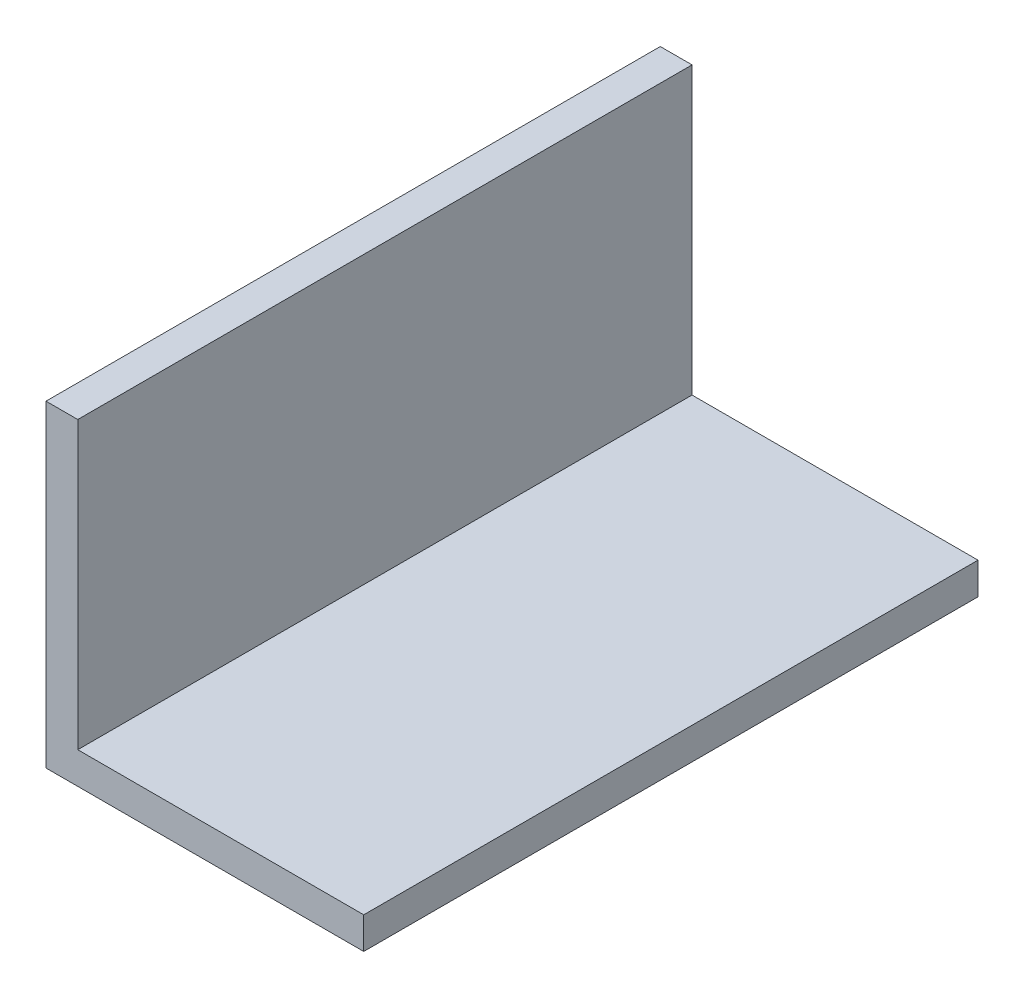
ISO-10303-21;
HEADER;
FILE_DESCRIPTION(('STEP AP214'),'2;1');
FILE_NAME('part.step','',(''),(''),'','','');
FILE_SCHEMA(('AUTOMOTIVE_DESIGN { 1 0 10303 214 1 1 1 1 }'));
ENDSEC;
DATA;
#1=APPLICATION_CONTEXT('core data for automotive mechanical design processes');
#2=APPLICATION_PROTOCOL_DEFINITION('international standard','automotive_design',2000,#1);
#3=PRODUCT_CONTEXT('',#1,'mechanical');
#4=PRODUCT('Part','Part','',(#3));
#5=PRODUCT_RELATED_PRODUCT_CATEGORY('part','',(#4));
#6=PRODUCT_DEFINITION_FORMATION('','',#4);
#7=PRODUCT_DEFINITION_CONTEXT('part definition',#1,'design');
#8=PRODUCT_DEFINITION('design','',#6,#7);
#9=PRODUCT_DEFINITION_SHAPE('','',#8);
#10=(LENGTH_UNIT() NAMED_UNIT(*) SI_UNIT(.MILLI.,.METRE.));
#11=(NAMED_UNIT(*) PLANE_ANGLE_UNIT() SI_UNIT($,.RADIAN.));
#12=(NAMED_UNIT(*) SI_UNIT($,.STERADIAN.) SOLID_ANGLE_UNIT());
#13=UNCERTAINTY_MEASURE_WITH_UNIT(LENGTH_MEASURE(1.E-05),#10,'distance_accuracy_value','');
#14=(GEOMETRIC_REPRESENTATION_CONTEXT(3) GLOBAL_UNCERTAINTY_ASSIGNED_CONTEXT((#13)) GLOBAL_UNIT_ASSIGNED_CONTEXT((#10,
#11,#12)) REPRESENTATION_CONTEXT('',''));
#15=CARTESIAN_POINT('',(0.,0.,0.));
#16=DIRECTION('',(0.,0.,1.));
#17=DIRECTION('',(1.,0.,0.));
#18=AXIS2_PLACEMENT_3D('',#15,#16,#17);
#19=CARTESIAN_POINT('',(0.,30.,58.));
#20=DIRECTION('',(0.,-1.,0.));
#21=DIRECTION('',(0.,0.,-1.));
#22=AXIS2_PLACEMENT_3D('',#19,#20,#21);
#23=PLANE('',#22);
#24=DIRECTION('',(-1.,0.,0.));
#25=VECTOR('',#24,1.);
#26=CARTESIAN_POINT('',(0.,30.,0.));
#27=LINE('',#26,#25);
#28=CARTESIAN_POINT('',(3.,30.,0.));
#29=VERTEX_POINT('',#28);
#30=CARTESIAN_POINT('',(0.,30.,0.));
#31=VERTEX_POINT('',#30);
#32=EDGE_CURVE('E119',#29,#31,#27,.T.);
#33=ORIENTED_EDGE('',*,*,#32,.T.);
#34=DIRECTION('',(0.,0.,-1.));
#35=VECTOR('',#34,1.);
#36=CARTESIAN_POINT('',(0.,30.,58.));
#37=LINE('',#36,#35);
#38=CARTESIAN_POINT('',(0.,30.,58.));
#39=VERTEX_POINT('',#38);
#40=EDGE_CURVE('E11',#39,#31,#37,.T.);
#41=ORIENTED_EDGE('',*,*,#40,.F.);
#42=DIRECTION('',(-1.,0.,0.));
#43=VECTOR('',#42,1.);
#44=CARTESIAN_POINT('',(0.,30.,58.));
#45=LINE('',#44,#43);
#46=CARTESIAN_POINT('',(3.,30.,58.));
#47=VERTEX_POINT('',#46);
#48=EDGE_CURVE('E129',#47,#39,#45,.T.);
#49=ORIENTED_EDGE('',*,*,#48,.F.);
#50=DIRECTION('',(0.,0.,-1.));
#51=VECTOR('',#50,1.);
#52=CARTESIAN_POINT('',(3.,30.,58.));
#53=LINE('',#52,#51);
#54=EDGE_CURVE('E115',#47,#29,#53,.T.);
#55=ORIENTED_EDGE('',*,*,#54,.T.);
#56=EDGE_LOOP('',(#33,#41,#49,#55));
#57=FACE_BOUND('',#56,.T.);
#58=ADVANCED_FACE('F35',(#57),#23,.F.);
#59=CARTESIAN_POINT('',(0.,30.,58.));
#60=DIRECTION('',(1.,0.,0.));
#61=DIRECTION('',(0.,1.,0.));
#62=AXIS2_PLACEMENT_3D('',#59,#60,#61);
#63=PLANE('',#62);
#64=DIRECTION('',(0.,-1.,0.));
#65=VECTOR('',#64,1.);
#66=CARTESIAN_POINT('',(0.,30.,0.));
#67=LINE('',#66,#65);
#68=CARTESIAN_POINT('',(0.,0.,0.));
#69=VERTEX_POINT('',#68);
#70=EDGE_CURVE('E122',#31,#69,#67,.T.);
#71=ORIENTED_EDGE('',*,*,#70,.T.);
#72=DIRECTION('',(0.,0.,-1.));
#73=VECTOR('',#72,1.);
#74=CARTESIAN_POINT('',(0.,0.,58.));
#75=LINE('',#74,#73);
#76=CARTESIAN_POINT('',(0.,0.,58.));
#77=VERTEX_POINT('',#76);
#78=EDGE_CURVE('E43',#77,#69,#75,.T.);
#79=ORIENTED_EDGE('',*,*,#78,.F.);
#80=DIRECTION('',(0.,-1.,0.));
#81=VECTOR('',#80,1.);
#82=CARTESIAN_POINT('',(0.,30.,58.));
#83=LINE('',#82,#81);
#84=EDGE_CURVE('E88',#39,#77,#83,.T.);
#85=ORIENTED_EDGE('',*,*,#84,.F.);
#86=ORIENTED_EDGE('',*,*,#40,.T.);
#87=EDGE_LOOP('',(#71,#79,#85,#86));
#88=FACE_BOUND('',#87,.T.);
#89=ADVANCED_FACE('F153',(#88),#63,.F.);
#90=CARTESIAN_POINT('',(0.,0.,58.));
#91=DIRECTION('',(0.,1.,0.));
#92=DIRECTION('',(0.,0.,1.));
#93=AXIS2_PLACEMENT_3D('',#90,#91,#92);
#94=PLANE('',#93);
#95=DIRECTION('',(1.,0.,0.));
#96=VECTOR('',#95,1.);
#97=CARTESIAN_POINT('',(0.,0.,0.));
#98=LINE('',#97,#96);
#99=CARTESIAN_POINT('',(30.,0.,0.));
#100=VERTEX_POINT('',#99);
#101=EDGE_CURVE('E124',#69,#100,#98,.T.);
#102=ORIENTED_EDGE('',*,*,#101,.T.);
#103=DIRECTION('',(0.,0.,-1.));
#104=VECTOR('',#103,1.);
#105=CARTESIAN_POINT('',(30.,0.,58.));
#106=LINE('',#105,#104);
#107=CARTESIAN_POINT('',(30.,0.,58.));
#108=VERTEX_POINT('',#107);
#109=EDGE_CURVE('E110',#108,#100,#106,.T.);
#110=ORIENTED_EDGE('',*,*,#109,.F.);
#111=DIRECTION('',(1.,0.,0.));
#112=VECTOR('',#111,1.);
#113=CARTESIAN_POINT('',(0.,0.,58.));
#114=LINE('',#113,#112);
#115=EDGE_CURVE('E101',#77,#108,#114,.T.);
#116=ORIENTED_EDGE('',*,*,#115,.F.);
#117=ORIENTED_EDGE('',*,*,#78,.T.);
#118=EDGE_LOOP('',(#102,#110,#116,#117));
#119=FACE_BOUND('',#118,.T.);
#120=ADVANCED_FACE('F135',(#119),#94,.F.);
#121=CARTESIAN_POINT('',(30.,3.,58.));
#122=DIRECTION('',(-1.,0.,0.));
#123=DIRECTION('',(0.,0.,1.));
#124=AXIS2_PLACEMENT_3D('',#121,#122,#123);
#125=PLANE('',#124);
#126=DIRECTION('',(0.,1.,0.));
#127=VECTOR('',#126,1.);
#128=CARTESIAN_POINT('',(30.,3.,0.));
#129=LINE('',#128,#127);
#130=CARTESIAN_POINT('',(30.,3.,0.));
#131=VERTEX_POINT('',#130);
#132=EDGE_CURVE('E109',#100,#131,#129,.T.);
#133=ORIENTED_EDGE('',*,*,#132,.T.);
#134=DIRECTION('',(0.,0.,-1.));
#135=VECTOR('',#134,1.);
#136=CARTESIAN_POINT('',(30.,3.,58.));
#137=LINE('',#136,#135);
#138=CARTESIAN_POINT('',(30.,3.,58.));
#139=VERTEX_POINT('',#138);
#140=EDGE_CURVE('E106',#139,#131,#137,.T.);
#141=ORIENTED_EDGE('',*,*,#140,.F.);
#142=DIRECTION('',(0.,1.,0.));
#143=VECTOR('',#142,1.);
#144=CARTESIAN_POINT('',(30.,3.,58.));
#145=LINE('',#144,#143);
#146=EDGE_CURVE('E95',#108,#139,#145,.T.);
#147=ORIENTED_EDGE('',*,*,#146,.F.);
#148=ORIENTED_EDGE('',*,*,#109,.T.);
#149=EDGE_LOOP('',(#133,#141,#147,#148));
#150=FACE_BOUND('',#149,.T.);
#151=ADVANCED_FACE('F107',(#150),#125,.F.);
#152=CARTESIAN_POINT('',(3.,3.,58.));
#153=DIRECTION('',(0.,-1.,0.));
#154=DIRECTION('',(0.,0.,-1.));
#155=AXIS2_PLACEMENT_3D('',#152,#153,#154);
#156=PLANE('',#155);
#157=DIRECTION('',(-1.,0.,0.));
#158=VECTOR('',#157,1.);
#159=CARTESIAN_POINT('',(3.,3.,0.));
#160=LINE('',#159,#158);
#161=CARTESIAN_POINT('',(3.,3.,0.));
#162=VERTEX_POINT('',#161);
#163=EDGE_CURVE('E74',#131,#162,#160,.T.);
#164=ORIENTED_EDGE('',*,*,#163,.T.);
#165=DIRECTION('',(0.,0.,-1.));
#166=VECTOR('',#165,1.);
#167=CARTESIAN_POINT('',(3.,3.,58.));
#168=LINE('',#167,#166);
#169=CARTESIAN_POINT('',(3.,3.,58.));
#170=VERTEX_POINT('',#169);
#171=EDGE_CURVE('E111',#170,#162,#168,.T.);
#172=ORIENTED_EDGE('',*,*,#171,.F.);
#173=DIRECTION('',(-1.,0.,0.));
#174=VECTOR('',#173,1.);
#175=CARTESIAN_POINT('',(3.,3.,58.));
#176=LINE('',#175,#174);
#177=EDGE_CURVE('E99',#139,#170,#176,.T.);
#178=ORIENTED_EDGE('',*,*,#177,.F.);
#179=ORIENTED_EDGE('',*,*,#140,.T.);
#180=EDGE_LOOP('',(#164,#172,#178,#179));
#181=FACE_BOUND('',#180,.T.);
#182=ADVANCED_FACE('F113',(#181),#156,.F.);
#183=CARTESIAN_POINT('',(3.,30.,58.));
#184=DIRECTION('',(-1.,0.,0.));
#185=DIRECTION('',(0.,-1.,0.));
#186=AXIS2_PLACEMENT_3D('',#183,#184,#185);
#187=PLANE('',#186);
#188=DIRECTION('',(0.,1.,0.));
#189=VECTOR('',#188,1.);
#190=CARTESIAN_POINT('',(3.,30.,0.));
#191=LINE('',#190,#189);
#192=EDGE_CURVE('E80',#162,#29,#191,.T.);
#193=ORIENTED_EDGE('',*,*,#192,.T.);
#194=ORIENTED_EDGE('',*,*,#54,.F.);
#195=DIRECTION('',(0.,1.,0.));
#196=VECTOR('',#195,1.);
#197=CARTESIAN_POINT('',(3.,30.,58.));
#198=LINE('',#197,#196);
#199=EDGE_CURVE('E51',#170,#47,#198,.T.);
#200=ORIENTED_EDGE('',*,*,#199,.F.);
#201=ORIENTED_EDGE('',*,*,#171,.T.);
#202=EDGE_LOOP('',(#193,#194,#200,#201));
#203=FACE_BOUND('',#202,.T.);
#204=ADVANCED_FACE('F142',(#203),#187,.F.);
#205=CARTESIAN_POINT('',(0.,0.,58.));
#206=DIRECTION('',(0.,0.,-1.));
#207=DIRECTION('',(-1.,0.,0.));
#208=AXIS2_PLACEMENT_3D('',#205,#206,#207);
#209=PLANE('',#208);
#210=ORIENTED_EDGE('',*,*,#48,.T.);
#211=ORIENTED_EDGE('',*,*,#84,.T.);
#212=ORIENTED_EDGE('',*,*,#115,.T.);
#213=ORIENTED_EDGE('',*,*,#146,.T.);
#214=ORIENTED_EDGE('',*,*,#177,.T.);
#215=ORIENTED_EDGE('',*,*,#199,.T.);
#216=EDGE_LOOP('',(#210,#211,#212,#213,#214,#215));
#217=FACE_BOUND('',#216,.T.);
#218=ADVANCED_FACE('F97',(#217),#209,.F.);
#219=CARTESIAN_POINT('',(0.,0.,0.));
#220=DIRECTION('',(0.,0.,-1.));
#221=DIRECTION('',(-1.,0.,0.));
#222=AXIS2_PLACEMENT_3D('',#219,#220,#221);
#223=PLANE('',#222);
#224=ORIENTED_EDGE('',*,*,#32,.F.);
#225=ORIENTED_EDGE('',*,*,#192,.F.);
#226=ORIENTED_EDGE('',*,*,#163,.F.);
#227=ORIENTED_EDGE('',*,*,#132,.F.);
#228=ORIENTED_EDGE('',*,*,#101,.F.);
#229=ORIENTED_EDGE('',*,*,#70,.F.);
#230=EDGE_LOOP('',(#224,#225,#226,#227,#228,#229));
#231=FACE_BOUND('',#230,.T.);
#232=ADVANCED_FACE('F138',(#231),#223,.T.);
#233=CLOSED_SHELL('',(#58,#89,#120,#151,#182,#204,#218,#232));
#234=MANIFOLD_SOLID_BREP('B2',#233);
#235=ADVANCED_BREP_SHAPE_REPRESENTATION('',(#18,#234),#14);
#236=SHAPE_DEFINITION_REPRESENTATION(#9,#235);
ENDSEC;
END-ISO-10303-21;
